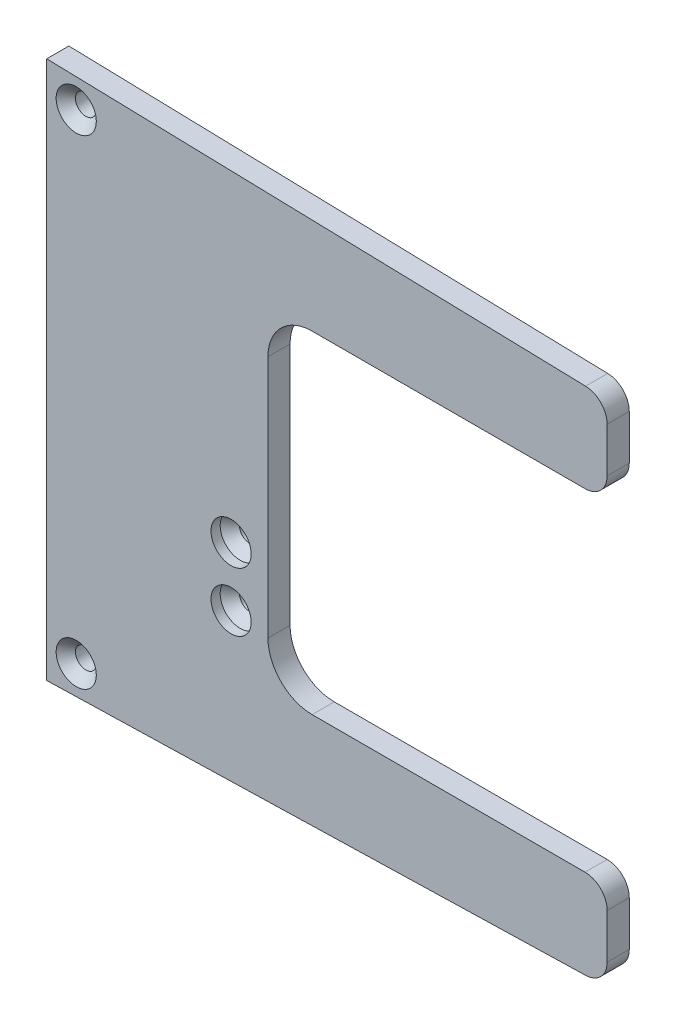
ISO-10303-21;
HEADER;
FILE_DESCRIPTION(('STEP AP214'),'2;1');
FILE_NAME('part.step','',(''),(''),'','','');
FILE_SCHEMA(('AUTOMOTIVE_DESIGN { 1 0 10303 214 1 1 1 1 }'));
ENDSEC;
DATA;
#1=APPLICATION_CONTEXT('core data for automotive mechanical design processes');
#2=APPLICATION_PROTOCOL_DEFINITION('international standard','automotive_design',2000,#1);
#3=PRODUCT_CONTEXT('',#1,'mechanical');
#4=PRODUCT('Part','Part','',(#3));
#5=PRODUCT_RELATED_PRODUCT_CATEGORY('part','',(#4));
#6=PRODUCT_DEFINITION_FORMATION('','',#4);
#7=PRODUCT_DEFINITION_CONTEXT('part definition',#1,'design');
#8=PRODUCT_DEFINITION('design','',#6,#7);
#9=PRODUCT_DEFINITION_SHAPE('','',#8);
#10=(LENGTH_UNIT() NAMED_UNIT(*) SI_UNIT(.MILLI.,.METRE.));
#11=(NAMED_UNIT(*) PLANE_ANGLE_UNIT() SI_UNIT($,.RADIAN.));
#12=(NAMED_UNIT(*) SI_UNIT($,.STERADIAN.) SOLID_ANGLE_UNIT());
#13=UNCERTAINTY_MEASURE_WITH_UNIT(LENGTH_MEASURE(1.E-05),#10,'distance_accuracy_value','');
#14=(GEOMETRIC_REPRESENTATION_CONTEXT(3) GLOBAL_UNCERTAINTY_ASSIGNED_CONTEXT((#13)) GLOBAL_UNIT_ASSIGNED_CONTEXT((#10,
#11,#12)) REPRESENTATION_CONTEXT('',''));
#15=CARTESIAN_POINT('',(0.,0.,0.));
#16=DIRECTION('',(0.,0.,1.));
#17=DIRECTION('',(1.,0.,0.));
#18=AXIS2_PLACEMENT_3D('',#15,#16,#17);
#19=CARTESIAN_POINT('',(-47.625,115.91925,9.525));
#20=DIRECTION('',(1.,0.,0.));
#21=DIRECTION('',(0.,1.,0.));
#22=AXIS2_PLACEMENT_3D('',#19,#20,#21);
#23=PLANE('',#22);
#24=DIRECTION('',(0.,-1.,0.));
#25=VECTOR('',#24,1.);
#26=CARTESIAN_POINT('',(-47.625,115.91925,0.));
#27=LINE('',#26,#25);
#28=CARTESIAN_POINT('',(-47.625,115.91925,0.));
#29=VERTEX_POINT('',#28);
#30=CARTESIAN_POINT('',(-47.625,-115.91925,0.));
#31=VERTEX_POINT('',#30);
#32=EDGE_CURVE('E161',#29,#31,#27,.T.);
#33=ORIENTED_EDGE('',*,*,#32,.T.);
#34=DIRECTION('',(0.,0.,-1.));
#35=VECTOR('',#34,1.);
#36=CARTESIAN_POINT('',(-47.625,-115.91925,9.525));
#37=LINE('',#36,#35);
#38=CARTESIAN_POINT('',(-47.625,-115.91925,9.525));
#39=VERTEX_POINT('',#38);
#40=EDGE_CURVE('E141',#39,#31,#37,.T.);
#41=ORIENTED_EDGE('',*,*,#40,.F.);
#42=DIRECTION('',(0.,-1.,0.));
#43=VECTOR('',#42,1.);
#44=CARTESIAN_POINT('',(-47.625,115.91925,9.525));
#45=LINE('',#44,#43);
#46=CARTESIAN_POINT('',(-47.625,115.91925,9.525));
#47=VERTEX_POINT('',#46);
#48=EDGE_CURVE('E150',#47,#39,#45,.T.);
#49=ORIENTED_EDGE('',*,*,#48,.F.);
#50=DIRECTION('',(0.,0.,-1.));
#51=VECTOR('',#50,1.);
#52=CARTESIAN_POINT('',(-47.625,115.91925,9.525));
#53=LINE('',#52,#51);
#54=EDGE_CURVE('E162',#47,#29,#53,.T.);
#55=ORIENTED_EDGE('',*,*,#54,.T.);
#56=EDGE_LOOP('',(#33,#41,#49,#55));
#57=FACE_BOUND('',#56,.T.);
#58=ADVANCED_FACE('F36',(#57),#23,.F.);
#59=CARTESIAN_POINT('',(47.625,115.91925,9.525));
#60=DIRECTION('',(-1.,0.,0.));
#61=DIRECTION('',(0.,-1.,0.));
#62=AXIS2_PLACEMENT_3D('',#59,#60,#61);
#63=PLANE('',#62);
#64=DIRECTION('',(0.,1.,0.));
#65=VECTOR('',#64,1.);
#66=CARTESIAN_POINT('',(47.625,115.91925,9.525));
#67=LINE('',#66,#65);
#68=CARTESIAN_POINT('',(47.625,-52.4505871253568,9.525));
#69=VERTEX_POINT('',#68);
#70=CARTESIAN_POINT('',(47.625,52.4505871253569,9.525));
#71=VERTEX_POINT('',#70);
#72=EDGE_CURVE('E156',#69,#71,#67,.T.);
#73=ORIENTED_EDGE('',*,*,#72,.F.);
#74=DIRECTION('',(0.,0.,1.));
#75=VECTOR('',#74,1.);
#76=CARTESIAN_POINT('',(47.625,-52.4505871253569,9.525));
#77=LINE('',#76,#75);
#78=CARTESIAN_POINT('',(47.625,-52.4505871253568,0.));
#79=VERTEX_POINT('',#78);
#80=EDGE_CURVE('E208',#69,#79,#77,.F.);
#81=ORIENTED_EDGE('',*,*,#80,.T.);
#82=DIRECTION('',(0.,1.,0.));
#83=VECTOR('',#82,1.);
#84=CARTESIAN_POINT('',(47.625,115.91925,0.));
#85=LINE('',#84,#83);
#86=CARTESIAN_POINT('',(47.625,52.4505871253569,0.));
#87=VERTEX_POINT('',#86);
#88=EDGE_CURVE('E157',#79,#87,#85,.T.);
#89=ORIENTED_EDGE('',*,*,#88,.T.);
#90=DIRECTION('',(0.,0.,1.));
#91=VECTOR('',#90,1.);
#92=CARTESIAN_POINT('',(47.625,52.4505871253569,9.525));
#93=LINE('',#92,#91);
#94=EDGE_CURVE('E205',#87,#71,#93,.T.);
#95=ORIENTED_EDGE('',*,*,#94,.T.);
#96=EDGE_LOOP('',(#73,#81,#89,#95));
#97=FACE_BOUND('',#96,.T.);
#98=ADVANCED_FACE('F238',(#97),#63,.F.);
#99=CARTESIAN_POINT('',(-47.625,-115.91925,9.525));
#100=DIRECTION('',(0.,0.,1.));
#101=DIRECTION('',(1.,0.,0.));
#102=AXIS2_PLACEMENT_3D('',#99,#100,#101);
#103=PLANE('',#102);
#104=DIRECTION('',(-0.999657324975558,-0.0261769483078661,0.));
#105=VECTOR('',#104,1.);
#106=CARTESIAN_POINT('',(47.625,-113.425040970536,9.525));
#107=LINE('',#106,#105);
#108=CARTESIAN_POINT('',(184.399335432632,-109.84347895022,9.525));
#109=VERTEX_POINT('',#108);
#110=EDGE_CURVE('E136',#109,#39,#107,.T.);
#111=ORIENTED_EDGE('',*,*,#110,.F.);
#112=CARTESIAN_POINT('',(184.15,-100.321742929828,9.525));
#113=DIRECTION('',(0.,0.,1.));
#114=DIRECTION('',(1.,0.,0.));
#115=AXIS2_PLACEMENT_3D('',#112,#113,#114);
#116=CIRCLE('',#115,9.525);
#117=CARTESIAN_POINT('',(193.675,-100.321742929828,9.525));
#118=VERTEX_POINT('',#117);
#119=EDGE_CURVE('E174',#109,#118,#116,.T.);
#120=ORIENTED_EDGE('',*,*,#119,.T.);
#121=DIRECTION('',(0.,1.,0.));
#122=VECTOR('',#121,1.);
#123=CARTESIAN_POINT('',(193.675,-71.5005871253569,9.525));
#124=LINE('',#123,#122);
#125=CARTESIAN_POINT('',(193.675,-81.0255871253569,9.525));
#126=VERTEX_POINT('',#125);
#127=EDGE_CURVE('E601',#118,#126,#124,.T.);
#128=ORIENTED_EDGE('',*,*,#127,.T.);
#129=CARTESIAN_POINT('',(184.15,-81.0255871253569,9.52500000000001));
#130=DIRECTION('',(0.,0.,1.));
#131=DIRECTION('',(1.,0.,0.));
#132=AXIS2_PLACEMENT_3D('',#129,#130,#131);
#133=CIRCLE('',#132,9.525);
#134=CARTESIAN_POINT('',(184.15,-71.5005871253569,9.525));
#135=VERTEX_POINT('',#134);
#136=EDGE_CURVE('E172',#126,#135,#133,.T.);
#137=ORIENTED_EDGE('',*,*,#136,.T.);
#138=DIRECTION('',(-1.,0.,0.));
#139=VECTOR('',#138,1.);
#140=CARTESIAN_POINT('',(47.625,-71.5005871253569,9.525));
#141=LINE('',#140,#139);
#142=CARTESIAN_POINT('',(66.675,-71.5005871253569,9.525));
#143=VERTEX_POINT('',#142);
#144=EDGE_CURVE('E236',#135,#143,#141,.T.);
#145=ORIENTED_EDGE('',*,*,#144,.T.);
#146=CARTESIAN_POINT('',(66.675,-52.4505871253569,9.52500000000001));
#147=DIRECTION('',(0.,0.,1.));
#148=DIRECTION('',(1.,0.,0.));
#149=AXIS2_PLACEMENT_3D('',#146,#147,#148);
#150=CIRCLE('',#149,19.05);
#151=EDGE_CURVE('E211',#143,#69,#150,.F.);
#152=ORIENTED_EDGE('',*,*,#151,.T.);
#153=ORIENTED_EDGE('',*,*,#72,.T.);
#154=CARTESIAN_POINT('',(66.675,52.4505871253569,9.525));
#155=DIRECTION('',(0.,0.,1.));
#156=DIRECTION('',(1.,0.,0.));
#157=AXIS2_PLACEMENT_3D('',#154,#155,#156);
#158=CIRCLE('',#157,19.05);
#159=CARTESIAN_POINT('',(66.675,71.5005871253569,9.525));
#160=VERTEX_POINT('',#159);
#161=EDGE_CURVE('E44',#71,#160,#158,.F.);
#162=ORIENTED_EDGE('',*,*,#161,.T.);
#163=DIRECTION('',(1.,0.,0.));
#164=VECTOR('',#163,1.);
#165=CARTESIAN_POINT('',(193.675,71.5005871253569,9.525));
#166=LINE('',#165,#164);
#167=CARTESIAN_POINT('',(184.15,71.5005871253569,9.525));
#168=VERTEX_POINT('',#167);
#169=EDGE_CURVE('E231',#160,#168,#166,.T.);
#170=ORIENTED_EDGE('',*,*,#169,.T.);
#171=CARTESIAN_POINT('',(184.15,81.0255871253569,9.52500000000001));
#172=DIRECTION('',(0.,0.,1.));
#173=DIRECTION('',(1.,0.,0.));
#174=AXIS2_PLACEMENT_3D('',#171,#172,#173);
#175=CIRCLE('',#174,9.525);
#176=CARTESIAN_POINT('',(193.675,81.0255871253569,9.525));
#177=VERTEX_POINT('',#176);
#178=EDGE_CURVE('E170',#168,#177,#175,.T.);
#179=ORIENTED_EDGE('',*,*,#178,.T.);
#180=DIRECTION('',(0.,1.,0.));
#181=VECTOR('',#180,1.);
#182=CARTESIAN_POINT('',(193.675,109.600587125357,9.525));
#183=LINE('',#182,#181);
#184=CARTESIAN_POINT('',(193.675,100.321742929828,9.525));
#185=VERTEX_POINT('',#184);
#186=EDGE_CURVE('E253',#177,#185,#183,.T.);
#187=ORIENTED_EDGE('',*,*,#186,.T.);
#188=CARTESIAN_POINT('',(184.15,100.321742929828,9.52500000000001));
#189=DIRECTION('',(0.,0.,1.));
#190=DIRECTION('',(1.,0.,0.));
#191=AXIS2_PLACEMENT_3D('',#188,#189,#190);
#192=CIRCLE('',#191,9.525);
#193=CARTESIAN_POINT('',(184.399335432632,109.84347895022,9.525));
#194=VERTEX_POINT('',#193);
#195=EDGE_CURVE('E164',#185,#194,#192,.T.);
#196=ORIENTED_EDGE('',*,*,#195,.T.);
#197=DIRECTION('',(0.999657324975557,-0.026176948307866,0.));
#198=VECTOR('',#197,1.);
#199=CARTESIAN_POINT('',(-47.625,115.91925,9.525));
#200=LINE('',#199,#198);
#201=EDGE_CURVE('E145',#47,#194,#200,.T.);
#202=ORIENTED_EDGE('',*,*,#201,.F.);
#203=ORIENTED_EDGE('',*,*,#48,.T.);
#204=EDGE_LOOP('',(#111,#120,#128,#137,#145,#152,#153,#162,#170,#179,#187,#196,#202,#203));
#205=FACE_BOUND('',#204,.T.);
#206=CARTESIAN_POINT('',(-34.925,103.21925,9.525));
#207=DIRECTION('',(0.,0.,1.));
#208=DIRECTION('',(1.,0.,0.));
#209=AXIS2_PLACEMENT_3D('',#206,#207,#208);
#210=CIRCLE('',#209,8.65);
#211=CARTESIAN_POINT('',(-26.275,103.21925,9.525));
#212=VERTEX_POINT('',#211);
#213=EDGE_CURVE('E261',#212,#212,#210,.T.);
#214=ORIENTED_EDGE('',*,*,#213,.F.);
#215=EDGE_LOOP('',(#214));
#216=FACE_BOUND('',#215,.T.);
#217=CARTESIAN_POINT('',(-34.925,-103.21925,9.525));
#218=DIRECTION('',(0.,0.,1.));
#219=DIRECTION('',(1.,0.,0.));
#220=AXIS2_PLACEMENT_3D('',#217,#218,#219);
#221=CIRCLE('',#220,8.65);
#222=CARTESIAN_POINT('',(-26.275,-103.21925,9.525));
#223=VERTEX_POINT('',#222);
#224=EDGE_CURVE('E270',#223,#223,#221,.T.);
#225=ORIENTED_EDGE('',*,*,#224,.F.);
#226=EDGE_LOOP('',(#225));
#227=FACE_BOUND('',#226,.T.);
#228=CARTESIAN_POINT('',(31.75,-50.15865,9.525));
#229=DIRECTION('',(0.,0.,1.));
#230=DIRECTION('',(1.,0.,0.));
#231=AXIS2_PLACEMENT_3D('',#228,#229,#230);
#232=CIRCLE('',#231,8.65);
#233=CARTESIAN_POINT('',(40.4,-50.15865,9.525));
#234=VERTEX_POINT('',#233);
#235=EDGE_CURVE('E288',#234,#234,#232,.T.);
#236=ORIENTED_EDGE('',*,*,#235,.F.);
#237=EDGE_LOOP('',(#236));
#238=FACE_BOUND('',#237,.T.);
#239=CARTESIAN_POINT('',(31.75,-24.75865,9.525));
#240=DIRECTION('',(0.,0.,1.));
#241=DIRECTION('',(1.,0.,0.));
#242=AXIS2_PLACEMENT_3D('',#239,#240,#241);
#243=CIRCLE('',#242,8.65);
#244=CARTESIAN_POINT('',(40.4,-24.75865,9.525));
#245=VERTEX_POINT('',#244);
#246=EDGE_CURVE('E243',#245,#245,#243,.T.);
#247=ORIENTED_EDGE('',*,*,#246,.F.);
#248=EDGE_LOOP('',(#247));
#249=FACE_BOUND('',#248,.T.);
#250=ADVANCED_FACE('F151',(#205,#216,#227,#238,#249),#103,.T.);
#251=CARTESIAN_POINT('',(-47.625,-115.91925,0.));
#252=DIRECTION('',(0.,0.,1.));
#253=DIRECTION('',(1.,0.,0.));
#254=AXIS2_PLACEMENT_3D('',#251,#252,#253);
#255=PLANE('',#254);
#256=CARTESIAN_POINT('',(-34.925,103.21925,0.));
#257=DIRECTION('',(0.,0.,1.));
#258=DIRECTION('',(1.,0.,0.));
#259=AXIS2_PLACEMENT_3D('',#256,#257,#258);
#260=CIRCLE('',#259,4.49999999999999);
#261=CARTESIAN_POINT('',(-30.425,103.21925,0.));
#262=VERTEX_POINT('',#261);
#263=EDGE_CURVE('E267',#262,#262,#260,.T.);
#264=ORIENTED_EDGE('',*,*,#263,.T.);
#265=EDGE_LOOP('',(#264));
#266=FACE_BOUND('',#265,.T.);
#267=CARTESIAN_POINT('',(-34.925,-103.21925,0.));
#268=DIRECTION('',(0.,0.,1.));
#269=DIRECTION('',(1.,0.,0.));
#270=AXIS2_PLACEMENT_3D('',#267,#268,#269);
#271=CIRCLE('',#270,4.49999999999999);
#272=CARTESIAN_POINT('',(-30.425,-103.21925,0.));
#273=VERTEX_POINT('',#272);
#274=EDGE_CURVE('E276',#273,#273,#271,.T.);
#275=ORIENTED_EDGE('',*,*,#274,.T.);
#276=EDGE_LOOP('',(#275));
#277=FACE_BOUND('',#276,.T.);
#278=CARTESIAN_POINT('',(31.75,-50.15865,0.));
#279=DIRECTION('',(0.,0.,1.));
#280=DIRECTION('',(1.,0.,0.));
#281=AXIS2_PLACEMENT_3D('',#278,#279,#280);
#282=CIRCLE('',#281,4.5);
#283=CARTESIAN_POINT('',(36.25,-50.15865,0.));
#284=VERTEX_POINT('',#283);
#285=EDGE_CURVE('E279',#284,#284,#282,.T.);
#286=ORIENTED_EDGE('',*,*,#285,.T.);
#287=EDGE_LOOP('',(#286));
#288=FACE_BOUND('',#287,.T.);
#289=CARTESIAN_POINT('',(31.75,-24.75865,0.));
#290=DIRECTION('',(0.,0.,1.));
#291=DIRECTION('',(1.,0.,0.));
#292=AXIS2_PLACEMENT_3D('',#289,#290,#291);
#293=CIRCLE('',#292,4.5);
#294=CARTESIAN_POINT('',(36.25,-24.75865,0.));
#295=VERTEX_POINT('',#294);
#296=EDGE_CURVE('E291',#295,#295,#293,.T.);
#297=ORIENTED_EDGE('',*,*,#296,.T.);
#298=EDGE_LOOP('',(#297));
#299=FACE_BOUND('',#298,.T.);
#300=DIRECTION('',(0.,-1.,0.));
#301=VECTOR('',#300,1.);
#302=CARTESIAN_POINT('',(193.675,-71.5005871253569,0.));
#303=LINE('',#302,#301);
#304=CARTESIAN_POINT('',(193.675,-81.0255871253569,0.));
#305=VERTEX_POINT('',#304);
#306=CARTESIAN_POINT('',(193.675,-100.321742929828,0.));
#307=VERTEX_POINT('',#306);
#308=EDGE_CURVE('E232',#305,#307,#303,.T.);
#309=ORIENTED_EDGE('',*,*,#308,.T.);
#310=CARTESIAN_POINT('',(184.15,-100.321742929828,0.));
#311=DIRECTION('',(0.,0.,1.));
#312=DIRECTION('',(1.,0.,0.));
#313=AXIS2_PLACEMENT_3D('',#310,#311,#312);
#314=CIRCLE('',#313,9.525);
#315=CARTESIAN_POINT('',(184.399335432632,-109.84347895022,0.));
#316=VERTEX_POINT('',#315);
#317=EDGE_CURVE('E187',#307,#316,#314,.F.);
#318=ORIENTED_EDGE('',*,*,#317,.T.);
#319=DIRECTION('',(0.999657324975558,0.0261769483078661,0.));
#320=VECTOR('',#319,1.);
#321=CARTESIAN_POINT('',(47.625,-113.425040970536,0.));
#322=LINE('',#321,#320);
#323=EDGE_CURVE('E146',#31,#316,#322,.T.);
#324=ORIENTED_EDGE('',*,*,#323,.F.);
#325=ORIENTED_EDGE('',*,*,#32,.F.);
#326=DIRECTION('',(-0.999657324975558,0.026176948307866,0.));
#327=VECTOR('',#326,1.);
#328=CARTESIAN_POINT('',(-47.625,115.91925,0.));
#329=LINE('',#328,#327);
#330=CARTESIAN_POINT('',(184.399335432632,109.84347895022,0.));
#331=VERTEX_POINT('',#330);
#332=EDGE_CURVE('E259',#331,#29,#329,.T.);
#333=ORIENTED_EDGE('',*,*,#332,.F.);
#334=CARTESIAN_POINT('',(184.15,100.321742929828,0.));
#335=DIRECTION('',(0.,0.,1.));
#336=DIRECTION('',(1.,0.,0.));
#337=AXIS2_PLACEMENT_3D('',#334,#335,#336);
#338=CIRCLE('',#337,9.525);
#339=CARTESIAN_POINT('',(193.675,100.321742929828,0.));
#340=VERTEX_POINT('',#339);
#341=EDGE_CURVE('E181',#331,#340,#338,.F.);
#342=ORIENTED_EDGE('',*,*,#341,.T.);
#343=DIRECTION('',(0.,-1.,0.));
#344=VECTOR('',#343,1.);
#345=CARTESIAN_POINT('',(193.675,109.600587125357,0.));
#346=LINE('',#345,#344);
#347=CARTESIAN_POINT('',(193.675,81.0255871253569,0.));
#348=VERTEX_POINT('',#347);
#349=EDGE_CURVE('E250',#340,#348,#346,.T.);
#350=ORIENTED_EDGE('',*,*,#349,.T.);
#351=CARTESIAN_POINT('',(184.15,81.0255871253569,0.));
#352=DIRECTION('',(0.,0.,1.));
#353=DIRECTION('',(1.,0.,0.));
#354=AXIS2_PLACEMENT_3D('',#351,#352,#353);
#355=CIRCLE('',#354,9.525);
#356=CARTESIAN_POINT('',(184.15,71.5005871253569,0.));
#357=VERTEX_POINT('',#356);
#358=EDGE_CURVE('E183',#348,#357,#355,.F.);
#359=ORIENTED_EDGE('',*,*,#358,.T.);
#360=DIRECTION('',(-1.,0.,0.));
#361=VECTOR('',#360,1.);
#362=CARTESIAN_POINT('',(193.675,71.5005871253569,0.));
#363=LINE('',#362,#361);
#364=CARTESIAN_POINT('',(66.675,71.5005871253569,0.));
#365=VERTEX_POINT('',#364);
#366=EDGE_CURVE('E246',#357,#365,#363,.T.);
#367=ORIENTED_EDGE('',*,*,#366,.T.);
#368=CARTESIAN_POINT('',(66.675,52.4505871253569,0.));
#369=DIRECTION('',(0.,0.,1.));
#370=DIRECTION('',(1.,0.,0.));
#371=AXIS2_PLACEMENT_3D('',#368,#369,#370);
#372=CIRCLE('',#371,19.05);
#373=EDGE_CURVE('E11',#365,#87,#372,.T.);
#374=ORIENTED_EDGE('',*,*,#373,.T.);
#375=ORIENTED_EDGE('',*,*,#88,.F.);
#376=CARTESIAN_POINT('',(66.675,-52.4505871253569,0.));
#377=DIRECTION('',(0.,0.,1.));
#378=DIRECTION('',(1.,0.,0.));
#379=AXIS2_PLACEMENT_3D('',#376,#377,#378);
#380=CIRCLE('',#379,19.05);
#381=CARTESIAN_POINT('',(66.675,-71.5005871253569,0.));
#382=VERTEX_POINT('',#381);
#383=EDGE_CURVE('E213',#79,#382,#380,.T.);
#384=ORIENTED_EDGE('',*,*,#383,.T.);
#385=DIRECTION('',(1.,0.,0.));
#386=VECTOR('',#385,1.);
#387=CARTESIAN_POINT('',(47.625,-71.5005871253569,0.));
#388=LINE('',#387,#386);
#389=CARTESIAN_POINT('',(184.15,-71.5005871253569,0.));
#390=VERTEX_POINT('',#389);
#391=EDGE_CURVE('E220',#382,#390,#388,.T.);
#392=ORIENTED_EDGE('',*,*,#391,.T.);
#393=CARTESIAN_POINT('',(184.15,-81.0255871253569,0.));
#394=DIRECTION('',(0.,0.,1.));
#395=DIRECTION('',(1.,0.,0.));
#396=AXIS2_PLACEMENT_3D('',#393,#394,#395);
#397=CIRCLE('',#396,9.525);
#398=EDGE_CURVE('E185',#390,#305,#397,.F.);
#399=ORIENTED_EDGE('',*,*,#398,.T.);
#400=EDGE_LOOP('',(#309,#318,#324,#325,#333,#342,#350,#359,#367,#374,#375,#384,#392,#399));
#401=FACE_BOUND('',#400,.T.);
#402=ADVANCED_FACE('F219',(#266,#277,#288,#299,#401),#255,.F.);
#403=CARTESIAN_POINT('',(31.75,-24.75865,9.525));
#404=DIRECTION('',(0.,0.,1.));
#405=DIRECTION('',(1.,0.,0.));
#406=AXIS2_PLACEMENT_3D('',#403,#404,#405);
#407=CYLINDRICAL_SURFACE('',#406,8.65);
#408=CARTESIAN_POINT('',(31.75,-24.75865,5.5626));
#409=DIRECTION('',(0.,0.,1.));
#410=DIRECTION('',(1.,0.,0.));
#411=AXIS2_PLACEMENT_3D('',#408,#409,#410);
#412=CIRCLE('',#411,8.65);
#413=CARTESIAN_POINT('',(40.4,-24.75865,5.5626));
#414=VERTEX_POINT('',#413);
#415=EDGE_CURVE('E297',#414,#414,#412,.T.);
#416=ORIENTED_EDGE('',*,*,#415,.F.);
#417=EDGE_LOOP('',(#416));
#418=FACE_BOUND('',#417,.T.);
#419=ORIENTED_EDGE('',*,*,#246,.T.);
#420=EDGE_LOOP('',(#419));
#421=FACE_BOUND('',#420,.T.);
#422=ADVANCED_FACE('F302',(#418,#421),#407,.F.);
#423=CARTESIAN_POINT('',(31.75,-24.75865,5.5626));
#424=DIRECTION('',(0.,0.,1.));
#425=DIRECTION('',(1.,0.,0.));
#426=AXIS2_PLACEMENT_3D('',#423,#424,#425);
#427=CONICAL_SURFACE('',#426,8.65,0.785398163397449);
#428=CARTESIAN_POINT('',(31.75,-24.75865,1.41260000000001));
#429=DIRECTION('',(0.,0.,1.));
#430=DIRECTION('',(1.,0.,0.));
#431=AXIS2_PLACEMENT_3D('',#428,#429,#430);
#432=CIRCLE('',#431,4.5);
#433=CARTESIAN_POINT('',(36.25,-24.75865,1.41260000000001));
#434=VERTEX_POINT('',#433);
#435=EDGE_CURVE('E294',#434,#434,#432,.T.);
#436=ORIENTED_EDGE('',*,*,#435,.F.);
#437=EDGE_LOOP('',(#436));
#438=FACE_BOUND('',#437,.T.);
#439=ORIENTED_EDGE('',*,*,#415,.T.);
#440=EDGE_LOOP('',(#439));
#441=FACE_BOUND('',#440,.T.);
#442=ADVANCED_FACE('F529',(#438,#441),#427,.F.);
#443=CARTESIAN_POINT('',(31.75,-24.75865,9.525));
#444=DIRECTION('',(0.,0.,1.));
#445=DIRECTION('',(1.,0.,0.));
#446=AXIS2_PLACEMENT_3D('',#443,#444,#445);
#447=CYLINDRICAL_SURFACE('',#446,4.5);
#448=ORIENTED_EDGE('',*,*,#296,.F.);
#449=EDGE_LOOP('',(#448));
#450=FACE_BOUND('',#449,.T.);
#451=ORIENTED_EDGE('',*,*,#435,.T.);
#452=EDGE_LOOP('',(#451));
#453=FACE_BOUND('',#452,.T.);
#454=ADVANCED_FACE('F519',(#450,#453),#447,.F.);
#455=CARTESIAN_POINT('',(31.75,-50.15865,9.525));
#456=DIRECTION('',(0.,0.,1.));
#457=DIRECTION('',(1.,0.,0.));
#458=AXIS2_PLACEMENT_3D('',#455,#456,#457);
#459=CYLINDRICAL_SURFACE('',#458,8.65);
#460=CARTESIAN_POINT('',(31.75,-50.15865,5.5626));
#461=DIRECTION('',(0.,0.,1.));
#462=DIRECTION('',(1.,0.,0.));
#463=AXIS2_PLACEMENT_3D('',#460,#461,#462);
#464=CIRCLE('',#463,8.65);
#465=CARTESIAN_POINT('',(40.4,-50.15865,5.5626));
#466=VERTEX_POINT('',#465);
#467=EDGE_CURVE('E285',#466,#466,#464,.T.);
#468=ORIENTED_EDGE('',*,*,#467,.F.);
#469=EDGE_LOOP('',(#468));
#470=FACE_BOUND('',#469,.T.);
#471=ORIENTED_EDGE('',*,*,#235,.T.);
#472=EDGE_LOOP('',(#471));
#473=FACE_BOUND('',#472,.T.);
#474=ADVANCED_FACE('F509',(#470,#473),#459,.F.);
#475=CARTESIAN_POINT('',(31.75,-50.15865,5.5626));
#476=DIRECTION('',(0.,0.,1.));
#477=DIRECTION('',(1.,0.,0.));
#478=AXIS2_PLACEMENT_3D('',#475,#476,#477);
#479=CONICAL_SURFACE('',#478,8.65,0.785398163397449);
#480=CARTESIAN_POINT('',(31.75,-50.15865,1.41260000000001));
#481=DIRECTION('',(0.,0.,1.));
#482=DIRECTION('',(1.,0.,0.));
#483=AXIS2_PLACEMENT_3D('',#480,#481,#482);
#484=CIRCLE('',#483,4.5);
#485=CARTESIAN_POINT('',(36.25,-50.15865,1.41260000000001));
#486=VERTEX_POINT('',#485);
#487=EDGE_CURVE('E282',#486,#486,#484,.T.);
#488=ORIENTED_EDGE('',*,*,#487,.F.);
#489=EDGE_LOOP('',(#488));
#490=FACE_BOUND('',#489,.T.);
#491=ORIENTED_EDGE('',*,*,#467,.T.);
#492=EDGE_LOOP('',(#491));
#493=FACE_BOUND('',#492,.T.);
#494=ADVANCED_FACE('F499',(#490,#493),#479,.F.);
#495=CARTESIAN_POINT('',(31.75,-50.15865,9.525));
#496=DIRECTION('',(0.,0.,1.));
#497=DIRECTION('',(1.,0.,0.));
#498=AXIS2_PLACEMENT_3D('',#495,#496,#497);
#499=CYLINDRICAL_SURFACE('',#498,4.5);
#500=ORIENTED_EDGE('',*,*,#285,.F.);
#501=EDGE_LOOP('',(#500));
#502=FACE_BOUND('',#501,.T.);
#503=ORIENTED_EDGE('',*,*,#487,.T.);
#504=EDGE_LOOP('',(#503));
#505=FACE_BOUND('',#504,.T.);
#506=ADVANCED_FACE('F489',(#502,#505),#499,.F.);
#507=CARTESIAN_POINT('',(-34.925,-103.21925,9.525));
#508=DIRECTION('',(0.,0.,1.));
#509=DIRECTION('',(1.,0.,0.));
#510=AXIS2_PLACEMENT_3D('',#507,#508,#509);
#511=CYLINDRICAL_SURFACE('',#510,4.49999999999999);
#512=ORIENTED_EDGE('',*,*,#274,.F.);
#513=EDGE_LOOP('',(#512));
#514=FACE_BOUND('',#513,.T.);
#515=CARTESIAN_POINT('',(-34.925,-103.21925,5.375));
#516=DIRECTION('',(0.,0.,1.));
#517=DIRECTION('',(1.,0.,0.));
#518=AXIS2_PLACEMENT_3D('',#515,#516,#517);
#519=CIRCLE('',#518,4.5);
#520=CARTESIAN_POINT('',(-30.425,-103.21925,5.375));
#521=VERTEX_POINT('',#520);
#522=EDGE_CURVE('E273',#521,#521,#519,.T.);
#523=ORIENTED_EDGE('',*,*,#522,.T.);
#524=EDGE_LOOP('',(#523));
#525=FACE_BOUND('',#524,.T.);
#526=ADVANCED_FACE('F479',(#514,#525),#511,.F.);
#527=CARTESIAN_POINT('',(-34.925,-103.21925,9.525));
#528=DIRECTION('',(0.,0.,1.));
#529=DIRECTION('',(1.,0.,0.));
#530=AXIS2_PLACEMENT_3D('',#527,#528,#529);
#531=CONICAL_SURFACE('',#530,8.65,0.785398163397448);
#532=ORIENTED_EDGE('',*,*,#522,.F.);
#533=EDGE_LOOP('',(#532));
#534=FACE_BOUND('',#533,.T.);
#535=ORIENTED_EDGE('',*,*,#224,.T.);
#536=EDGE_LOOP('',(#535));
#537=FACE_BOUND('',#536,.T.);
#538=ADVANCED_FACE('F469',(#534,#537),#531,.F.);
#539=CARTESIAN_POINT('',(-34.925,103.21925,9.525));
#540=DIRECTION('',(0.,0.,1.));
#541=DIRECTION('',(1.,0.,0.));
#542=AXIS2_PLACEMENT_3D('',#539,#540,#541);
#543=CYLINDRICAL_SURFACE('',#542,4.49999999999999);
#544=ORIENTED_EDGE('',*,*,#263,.F.);
#545=EDGE_LOOP('',(#544));
#546=FACE_BOUND('',#545,.T.);
#547=CARTESIAN_POINT('',(-34.925,103.21925,5.375));
#548=DIRECTION('',(0.,0.,1.));
#549=DIRECTION('',(1.,0.,0.));
#550=AXIS2_PLACEMENT_3D('',#547,#548,#549);
#551=CIRCLE('',#550,4.5);
#552=CARTESIAN_POINT('',(-30.425,103.21925,5.375));
#553=VERTEX_POINT('',#552);
#554=EDGE_CURVE('E264',#553,#553,#551,.T.);
#555=ORIENTED_EDGE('',*,*,#554,.T.);
#556=EDGE_LOOP('',(#555));
#557=FACE_BOUND('',#556,.T.);
#558=ADVANCED_FACE('F459',(#546,#557),#543,.F.);
#559=CARTESIAN_POINT('',(-34.925,103.21925,9.525));
#560=DIRECTION('',(0.,0.,1.));
#561=DIRECTION('',(1.,0.,0.));
#562=AXIS2_PLACEMENT_3D('',#559,#560,#561);
#563=CONICAL_SURFACE('',#562,8.65,0.785398163397448);
#564=ORIENTED_EDGE('',*,*,#554,.F.);
#565=EDGE_LOOP('',(#564));
#566=FACE_BOUND('',#565,.T.);
#567=ORIENTED_EDGE('',*,*,#213,.T.);
#568=EDGE_LOOP('',(#567));
#569=FACE_BOUND('',#568,.T.);
#570=ADVANCED_FACE('F444',(#566,#569),#563,.F.);
#571=CARTESIAN_POINT('',(-47.625,115.91925,-0.00100000000000447));
#572=DIRECTION('',(-0.026176948307866,-0.999657324975557,0.));
#573=DIRECTION('',(0.999657324975558,-0.026176948307866,0.));
#574=AXIS2_PLACEMENT_3D('',#571,#572,#573);
#575=PLANE('',#574);
#576=ORIENTED_EDGE('',*,*,#201,.T.);
#577=DIRECTION('',(0.,0.,1.));
#578=VECTOR('',#577,1.);
#579=CARTESIAN_POINT('',(184.399335432632,109.84347895022,0.));
#580=LINE('',#579,#578);
#581=EDGE_CURVE('E200',#194,#331,#580,.F.);
#582=ORIENTED_EDGE('',*,*,#581,.T.);
#583=ORIENTED_EDGE('',*,*,#332,.T.);
#584=ORIENTED_EDGE('',*,*,#54,.F.);
#585=EDGE_LOOP('',(#576,#582,#583,#584));
#586=FACE_BOUND('',#585,.T.);
#587=ADVANCED_FACE('F436',(#586),#575,.F.);
#588=CARTESIAN_POINT('',(47.625,-113.425040970536,-0.00100000000000447));
#589=DIRECTION('',(-0.0261769483078661,0.999657324975557,0.));
#590=DIRECTION('',(-0.999657324975558,-0.0261769483078661,0.));
#591=AXIS2_PLACEMENT_3D('',#588,#589,#590);
#592=PLANE('',#591);
#593=ORIENTED_EDGE('',*,*,#323,.T.);
#594=DIRECTION('',(0.,0.,1.));
#595=VECTOR('',#594,1.);
#596=CARTESIAN_POINT('',(184.399335432632,-109.84347895022,9.525));
#597=LINE('',#596,#595);
#598=EDGE_CURVE('E144',#316,#109,#597,.T.);
#599=ORIENTED_EDGE('',*,*,#598,.T.);
#600=ORIENTED_EDGE('',*,*,#110,.T.);
#601=ORIENTED_EDGE('',*,*,#40,.T.);
#602=EDGE_LOOP('',(#593,#599,#600,#601));
#603=FACE_BOUND('',#602,.T.);
#604=ADVANCED_FACE('F139',(#603),#592,.F.);
#605=CARTESIAN_POINT('',(193.675,109.600587125357,-151.948222530626));
#606=DIRECTION('',(1.,0.,0.));
#607=DIRECTION('',(0.,0.,-1.));
#608=AXIS2_PLACEMENT_3D('',#605,#606,#607);
#609=PLANE('',#608);
#610=ORIENTED_EDGE('',*,*,#186,.F.);
#611=DIRECTION('',(0.,0.,1.));
#612=VECTOR('',#611,1.);
#613=CARTESIAN_POINT('',(193.675,81.0255871253569,-151.948222530626));
#614=LINE('',#613,#612);
#615=EDGE_CURVE('E198',#177,#348,#614,.F.);
#616=ORIENTED_EDGE('',*,*,#615,.T.);
#617=ORIENTED_EDGE('',*,*,#349,.F.);
#618=DIRECTION('',(0.,0.,1.));
#619=VECTOR('',#618,1.);
#620=CARTESIAN_POINT('',(193.675,100.321742929828,9.52500000000001));
#621=LINE('',#620,#619);
#622=EDGE_CURVE('E195',#340,#185,#621,.T.);
#623=ORIENTED_EDGE('',*,*,#622,.T.);
#624=EDGE_LOOP('',(#610,#616,#617,#623));
#625=FACE_BOUND('',#624,.T.);
#626=ADVANCED_FACE('F366',(#625),#609,.T.);
#627=CARTESIAN_POINT('',(193.675,71.5005871253569,-151.948222530626));
#628=DIRECTION('',(0.,-1.,0.));
#629=DIRECTION('',(1.,0.,0.));
#630=AXIS2_PLACEMENT_3D('',#627,#628,#629);
#631=PLANE('',#630);
#632=ORIENTED_EDGE('',*,*,#169,.F.);
#633=DIRECTION('',(0.,0.,1.));
#634=VECTOR('',#633,1.);
#635=CARTESIAN_POINT('',(66.675,71.5005871253569,-151.948222530626));
#636=LINE('',#635,#634);
#637=EDGE_CURVE('E57',#160,#365,#636,.F.);
#638=ORIENTED_EDGE('',*,*,#637,.T.);
#639=ORIENTED_EDGE('',*,*,#366,.F.);
#640=DIRECTION('',(0.,0.,1.));
#641=VECTOR('',#640,1.);
#642=CARTESIAN_POINT('',(184.15,71.5005871253569,-151.948222530626));
#643=LINE('',#642,#641);
#644=EDGE_CURVE('E192',#357,#168,#643,.T.);
#645=ORIENTED_EDGE('',*,*,#644,.T.);
#646=EDGE_LOOP('',(#632,#638,#639,#645));
#647=FACE_BOUND('',#646,.T.);
#648=ADVANCED_FACE('F355',(#647),#631,.T.);
#649=CARTESIAN_POINT('',(47.625,-71.5005871253569,-151.948222530626));
#650=DIRECTION('',(0.,1.,0.));
#651=DIRECTION('',(0.,0.,1.));
#652=AXIS2_PLACEMENT_3D('',#649,#650,#651);
#653=PLANE('',#652);
#654=ORIENTED_EDGE('',*,*,#391,.F.);
#655=DIRECTION('',(0.,0.,1.));
#656=VECTOR('',#655,1.);
#657=CARTESIAN_POINT('',(66.675,-71.5005871253569,-151.948222530626));
#658=LINE('',#657,#656);
#659=EDGE_CURVE('E202',#382,#143,#658,.T.);
#660=ORIENTED_EDGE('',*,*,#659,.T.);
#661=ORIENTED_EDGE('',*,*,#144,.F.);
#662=DIRECTION('',(0.,0.,1.));
#663=VECTOR('',#662,1.);
#664=CARTESIAN_POINT('',(184.15,-71.5005871253569,-151.948222530626));
#665=LINE('',#664,#663);
#666=EDGE_CURVE('E189',#135,#390,#665,.F.);
#667=ORIENTED_EDGE('',*,*,#666,.T.);
#668=EDGE_LOOP('',(#654,#660,#661,#667));
#669=FACE_BOUND('',#668,.T.);
#670=ADVANCED_FACE('F226',(#669),#653,.T.);
#671=CARTESIAN_POINT('',(193.675,-71.5005871253569,-151.948222530626));
#672=DIRECTION('',(1.,0.,0.));
#673=DIRECTION('',(0.,1.,0.));
#674=AXIS2_PLACEMENT_3D('',#671,#672,#673);
#675=PLANE('',#674);
#676=ORIENTED_EDGE('',*,*,#127,.F.);
#677=DIRECTION('',(0.,0.,1.));
#678=VECTOR('',#677,1.);
#679=CARTESIAN_POINT('',(193.675,-100.321742929828,0.));
#680=LINE('',#679,#678);
#681=EDGE_CURVE('E179',#118,#307,#680,.F.);
#682=ORIENTED_EDGE('',*,*,#681,.T.);
#683=ORIENTED_EDGE('',*,*,#308,.F.);
#684=DIRECTION('',(0.,0.,1.));
#685=VECTOR('',#684,1.);
#686=CARTESIAN_POINT('',(193.675,-81.0255871253569,-151.948222530626));
#687=LINE('',#686,#685);
#688=EDGE_CURVE('E176',#305,#126,#687,.T.);
#689=ORIENTED_EDGE('',*,*,#688,.T.);
#690=EDGE_LOOP('',(#676,#682,#683,#689));
#691=FACE_BOUND('',#690,.T.);
#692=ADVANCED_FACE('F323',(#691),#675,.T.);
#693=CARTESIAN_POINT('',(184.15,-100.321742929828,-0.00100000000000447));
#694=DIRECTION('',(0.,0.,-1.));
#695=DIRECTION('',(-1.,0.,0.));
#696=AXIS2_PLACEMENT_3D('',#693,#694,#695);
#697=CYLINDRICAL_SURFACE('',#696,9.525);
#698=ORIENTED_EDGE('',*,*,#317,.F.);
#699=ORIENTED_EDGE('',*,*,#681,.F.);
#700=ORIENTED_EDGE('',*,*,#119,.F.);
#701=ORIENTED_EDGE('',*,*,#598,.F.);
#702=EDGE_LOOP('',(#698,#699,#700,#701));
#703=FACE_BOUND('',#702,.T.);
#704=ADVANCED_FACE('F319',(#703),#697,.T.);
#705=CARTESIAN_POINT('',(184.15,-81.0255871253569,-151.948222530626));
#706=DIRECTION('',(0.,0.,1.));
#707=DIRECTION('',(1.,0.,0.));
#708=AXIS2_PLACEMENT_3D('',#705,#706,#707);
#709=CYLINDRICAL_SURFACE('',#708,9.525);
#710=ORIENTED_EDGE('',*,*,#398,.F.);
#711=ORIENTED_EDGE('',*,*,#666,.F.);
#712=ORIENTED_EDGE('',*,*,#136,.F.);
#713=ORIENTED_EDGE('',*,*,#688,.F.);
#714=EDGE_LOOP('',(#710,#711,#712,#713));
#715=FACE_BOUND('',#714,.T.);
#716=ADVANCED_FACE('F322',(#715),#709,.T.);
#717=CARTESIAN_POINT('',(184.15,81.0255871253569,-151.948222530626));
#718=DIRECTION('',(0.,0.,1.));
#719=DIRECTION('',(1.,0.,0.));
#720=AXIS2_PLACEMENT_3D('',#717,#718,#719);
#721=CYLINDRICAL_SURFACE('',#720,9.525);
#722=ORIENTED_EDGE('',*,*,#358,.F.);
#723=ORIENTED_EDGE('',*,*,#615,.F.);
#724=ORIENTED_EDGE('',*,*,#178,.F.);
#725=ORIENTED_EDGE('',*,*,#644,.F.);
#726=EDGE_LOOP('',(#722,#723,#724,#725));
#727=FACE_BOUND('',#726,.T.);
#728=ADVANCED_FACE('F327',(#727),#721,.T.);
#729=CARTESIAN_POINT('',(184.15,100.321742929828,-151.948222530626));
#730=DIRECTION('',(0.,0.,-1.));
#731=DIRECTION('',(-1.,0.,0.));
#732=AXIS2_PLACEMENT_3D('',#729,#730,#731);
#733=CYLINDRICAL_SURFACE('',#732,9.525);
#734=ORIENTED_EDGE('',*,*,#341,.F.);
#735=ORIENTED_EDGE('',*,*,#581,.F.);
#736=ORIENTED_EDGE('',*,*,#195,.F.);
#737=ORIENTED_EDGE('',*,*,#622,.F.);
#738=EDGE_LOOP('',(#734,#735,#736,#737));
#739=FACE_BOUND('',#738,.T.);
#740=ADVANCED_FACE('F331',(#739),#733,.T.);
#741=CARTESIAN_POINT('',(66.675,-52.4505871253569,-151.948222530626));
#742=DIRECTION('',(0.,0.,1.));
#743=DIRECTION('',(1.,0.,0.));
#744=AXIS2_PLACEMENT_3D('',#741,#742,#743);
#745=CYLINDRICAL_SURFACE('',#744,19.05);
#746=ORIENTED_EDGE('',*,*,#383,.F.);
#747=ORIENTED_EDGE('',*,*,#80,.F.);
#748=ORIENTED_EDGE('',*,*,#151,.F.);
#749=ORIENTED_EDGE('',*,*,#659,.F.);
#750=EDGE_LOOP('',(#746,#747,#748,#749));
#751=FACE_BOUND('',#750,.T.);
#752=ADVANCED_FACE('F234',(#751),#745,.F.);
#753=CARTESIAN_POINT('',(66.675,52.4505871253569,9.525));
#754=DIRECTION('',(0.,0.,1.));
#755=DIRECTION('',(1.,0.,0.));
#756=AXIS2_PLACEMENT_3D('',#753,#754,#755);
#757=CYLINDRICAL_SURFACE('',#756,19.05);
#758=ORIENTED_EDGE('',*,*,#373,.F.);
#759=ORIENTED_EDGE('',*,*,#637,.F.);
#760=ORIENTED_EDGE('',*,*,#161,.F.);
#761=ORIENTED_EDGE('',*,*,#94,.F.);
#762=EDGE_LOOP('',(#758,#759,#760,#761));
#763=FACE_BOUND('',#762,.T.);
#764=ADVANCED_FACE('F38',(#763),#757,.F.);
#765=CLOSED_SHELL('',(#58,#98,#250,#402,#422,#442,#454,#474,#494,#506,#526,#538,#558,#570,#587,
#604,#626,#648,#670,#692,#704,#716,#728,#740,#752,#764));
#766=MANIFOLD_SOLID_BREP('B2',#765);
#767=ADVANCED_BREP_SHAPE_REPRESENTATION('',(#18,#766),#14);
#768=SHAPE_DEFINITION_REPRESENTATION(#9,#767);
ENDSEC;
END-ISO-10303-21;
